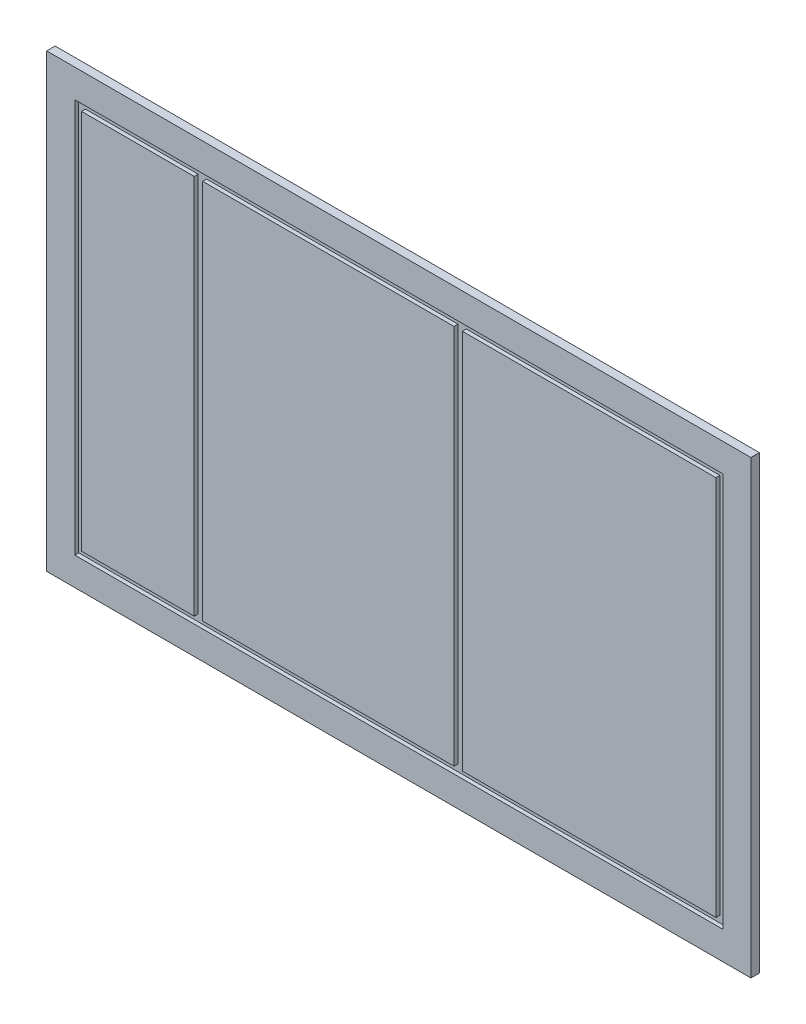
ISO-10303-21;
HEADER;
FILE_DESCRIPTION(('STEP AP214'),'2;1');
FILE_NAME('part.step','',(''),(''),'','','');
FILE_SCHEMA(('AUTOMOTIVE_DESIGN { 1 0 10303 214 1 1 1 1 }'));
ENDSEC;
DATA;
#1=APPLICATION_CONTEXT('core data for automotive mechanical design processes');
#2=APPLICATION_PROTOCOL_DEFINITION('international standard','automotive_design',2000,#1);
#3=PRODUCT_CONTEXT('',#1,'mechanical');
#4=PRODUCT('Part','Part','',(#3));
#5=PRODUCT_RELATED_PRODUCT_CATEGORY('part','',(#4));
#6=PRODUCT_DEFINITION_FORMATION('','',#4);
#7=PRODUCT_DEFINITION_CONTEXT('part definition',#1,'design');
#8=PRODUCT_DEFINITION('design','',#6,#7);
#9=PRODUCT_DEFINITION_SHAPE('','',#8);
#10=(LENGTH_UNIT() NAMED_UNIT(*) SI_UNIT(.MILLI.,.METRE.));
#11=(NAMED_UNIT(*) PLANE_ANGLE_UNIT() SI_UNIT($,.RADIAN.));
#12=(NAMED_UNIT(*) SI_UNIT($,.STERADIAN.) SOLID_ANGLE_UNIT());
#13=UNCERTAINTY_MEASURE_WITH_UNIT(LENGTH_MEASURE(1.E-05),#10,'distance_accuracy_value','');
#14=(GEOMETRIC_REPRESENTATION_CONTEXT(3) GLOBAL_UNCERTAINTY_ASSIGNED_CONTEXT((#13)) GLOBAL_UNIT_ASSIGNED_CONTEXT((#10,
#11,#12)) REPRESENTATION_CONTEXT('',''));
#15=CARTESIAN_POINT('',(0.,0.,0.));
#16=DIRECTION('',(0.,0.,1.));
#17=DIRECTION('',(1.,0.,0.));
#18=AXIS2_PLACEMENT_3D('',#15,#16,#17);
#19=CARTESIAN_POINT('',(563.,338.,8.));
#20=DIRECTION('',(0.,1.,0.));
#21=DIRECTION('',(0.,0.,1.));
#22=AXIS2_PLACEMENT_3D('',#19,#20,#21);
#23=PLANE('',#22);
#24=DIRECTION('',(0.,0.,1.));
#25=VECTOR('',#24,1.);
#26=CARTESIAN_POINT('',(98.0000000000003,338.,8.));
#27=LINE('',#26,#25);
#28=CARTESIAN_POINT('',(98.0000000000003,338.,8.));
#29=VERTEX_POINT('',#28);
#30=CARTESIAN_POINT('',(98.0000000000003,338.,15.));
#31=VERTEX_POINT('',#30);
#32=EDGE_CURVE('E357',#29,#31,#27,.T.);
#33=ORIENTED_EDGE('',*,*,#32,.F.);
#34=DIRECTION('',(-1.,0.,0.));
#35=VECTOR('',#34,1.);
#36=CARTESIAN_POINT('',(563.,338.,8.));
#37=LINE('',#36,#35);
#38=CARTESIAN_POINT('',(-348.,338.,8.));
#39=VERTEX_POINT('',#38);
#40=EDGE_CURVE('E192',#29,#39,#37,.T.);
#41=ORIENTED_EDGE('',*,*,#40,.T.);
#42=DIRECTION('',(0.,0.,1.));
#43=VECTOR('',#42,1.);
#44=CARTESIAN_POINT('',(-348.,338.,8.));
#45=LINE('',#44,#43);
#46=CARTESIAN_POINT('',(-348.,338.,15.));
#47=VERTEX_POINT('',#46);
#48=EDGE_CURVE('E386',#39,#47,#45,.T.);
#49=ORIENTED_EDGE('',*,*,#48,.T.);
#50=DIRECTION('',(-1.,0.,0.));
#51=VECTOR('',#50,1.);
#52=CARTESIAN_POINT('',(563.,338.,15.));
#53=LINE('',#52,#51);
#54=EDGE_CURVE('E228',#31,#47,#53,.T.);
#55=ORIENTED_EDGE('',*,*,#54,.F.);
#56=EDGE_LOOP('',(#33,#41,#49,#55));
#57=FACE_BOUND('',#56,.T.);
#58=ADVANCED_FACE('F35',(#57),#23,.T.);
#59=CARTESIAN_POINT('',(563.,-338.,8.));
#60=DIRECTION('',(0.,-1.,0.));
#61=DIRECTION('',(0.,0.,-1.));
#62=AXIS2_PLACEMENT_3D('',#59,#60,#61);
#63=PLANE('',#62);
#64=DIRECTION('',(0.,0.,1.));
#65=VECTOR('',#64,1.);
#66=CARTESIAN_POINT('',(98.0000000000004,-338.,8.));
#67=LINE('',#66,#65);
#68=CARTESIAN_POINT('',(98.0000000000004,-338.,8.));
#69=VERTEX_POINT('',#68);
#70=CARTESIAN_POINT('',(98.0000000000004,-338.,15.));
#71=VERTEX_POINT('',#70);
#72=EDGE_CURVE('E172',#69,#71,#67,.T.);
#73=ORIENTED_EDGE('',*,*,#72,.T.);
#74=DIRECTION('',(1.,0.,0.));
#75=VECTOR('',#74,1.);
#76=CARTESIAN_POINT('',(563.,-338.,15.));
#77=LINE('',#76,#75);
#78=CARTESIAN_POINT('',(-348.,-338.,15.));
#79=VERTEX_POINT('',#78);
#80=EDGE_CURVE('E221',#79,#71,#77,.T.);
#81=ORIENTED_EDGE('',*,*,#80,.F.);
#82=DIRECTION('',(0.,0.,1.));
#83=VECTOR('',#82,1.);
#84=CARTESIAN_POINT('',(-348.,-338.,8.));
#85=LINE('',#84,#83);
#86=CARTESIAN_POINT('',(-348.,-338.,8.));
#87=VERTEX_POINT('',#86);
#88=EDGE_CURVE('E58',#87,#79,#85,.T.);
#89=ORIENTED_EDGE('',*,*,#88,.F.);
#90=DIRECTION('',(1.,0.,0.));
#91=VECTOR('',#90,1.);
#92=CARTESIAN_POINT('',(563.,-338.,8.));
#93=LINE('',#92,#91);
#94=EDGE_CURVE('E191',#87,#69,#93,.T.);
#95=ORIENTED_EDGE('',*,*,#94,.T.);
#96=EDGE_LOOP('',(#73,#81,#89,#95));
#97=FACE_BOUND('',#96,.T.);
#98=ADVANCED_FACE('F195',(#97),#63,.T.);
#99=CARTESIAN_POINT('',(0.,0.,15.));
#100=DIRECTION('',(0.,0.,1.));
#101=DIRECTION('',(1.,0.,0.));
#102=AXIS2_PLACEMENT_3D('',#99,#100,#101);
#103=PLANE('',#102);
#104=DIRECTION('',(0.,-1.,0.));
#105=VECTOR('',#104,1.);
#106=CARTESIAN_POINT('',(98.0000000000003,338.,15.));
#107=LINE('',#106,#105);
#108=EDGE_CURVE('E178',#31,#71,#107,.T.);
#109=ORIENTED_EDGE('',*,*,#108,.F.);
#110=ORIENTED_EDGE('',*,*,#54,.T.);
#111=DIRECTION('',(0.,1.,0.));
#112=VECTOR('',#111,1.);
#113=CARTESIAN_POINT('',(-348.,338.,15.));
#114=LINE('',#113,#112);
#115=EDGE_CURVE('E380',#79,#47,#114,.T.);
#116=ORIENTED_EDGE('',*,*,#115,.F.);
#117=ORIENTED_EDGE('',*,*,#80,.T.);
#118=EDGE_LOOP('',(#109,#110,#116,#117));
#119=FACE_BOUND('',#118,.T.);
#120=ADVANCED_FACE('F331',(#119),#103,.T.);
#121=DIRECTION('',(0.,0.,1.));
#122=VECTOR('',#121,1.);
#123=CARTESIAN_POINT('',(-363.,338.,8.));
#124=LINE('',#123,#122);
#125=CARTESIAN_POINT('',(-363.,338.,8.));
#126=VERTEX_POINT('',#125);
#127=CARTESIAN_POINT('',(-363.,338.,15.));
#128=VERTEX_POINT('',#127);
#129=EDGE_CURVE('E216',#126,#128,#124,.T.);
#130=ORIENTED_EDGE('',*,*,#129,.F.);
#131=CARTESIAN_POINT('',(-563.,338.,8.));
#132=VERTEX_POINT('',#131);
#133=EDGE_CURVE('E207',#126,#132,#37,.T.);
#134=ORIENTED_EDGE('',*,*,#133,.T.);
#135=DIRECTION('',(0.,0.,1.));
#136=VECTOR('',#135,1.);
#137=CARTESIAN_POINT('',(-563.,338.,8.));
#138=LINE('',#137,#136);
#139=CARTESIAN_POINT('',(-563.,338.,15.));
#140=VERTEX_POINT('',#139);
#141=EDGE_CURVE('E229',#132,#140,#138,.T.);
#142=ORIENTED_EDGE('',*,*,#141,.T.);
#143=EDGE_CURVE('E224',#128,#140,#53,.T.);
#144=ORIENTED_EDGE('',*,*,#143,.F.);
#145=EDGE_LOOP('',(#130,#134,#142,#144));
#146=FACE_BOUND('',#145,.T.);
#147=ADVANCED_FACE('F325',(#146),#23,.T.);
#148=DIRECTION('',(0.,0.,1.));
#149=VECTOR('',#148,1.);
#150=CARTESIAN_POINT('',(-363.,-338.,8.));
#151=LINE('',#150,#149);
#152=CARTESIAN_POINT('',(-363.,-338.,8.));
#153=VERTEX_POINT('',#152);
#154=CARTESIAN_POINT('',(-363.,-338.,15.));
#155=VERTEX_POINT('',#154);
#156=EDGE_CURVE('E382',#153,#155,#151,.T.);
#157=ORIENTED_EDGE('',*,*,#156,.T.);
#158=CARTESIAN_POINT('',(-563.,-338.,15.));
#159=VERTEX_POINT('',#158);
#160=EDGE_CURVE('E217',#159,#155,#77,.T.);
#161=ORIENTED_EDGE('',*,*,#160,.F.);
#162=DIRECTION('',(0.,0.,1.));
#163=VECTOR('',#162,1.);
#164=CARTESIAN_POINT('',(-563.,-338.,8.));
#165=LINE('',#164,#163);
#166=CARTESIAN_POINT('',(-563.,-338.,8.));
#167=VERTEX_POINT('',#166);
#168=EDGE_CURVE('E211',#167,#159,#165,.T.);
#169=ORIENTED_EDGE('',*,*,#168,.F.);
#170=EDGE_CURVE('E196',#167,#153,#93,.T.);
#171=ORIENTED_EDGE('',*,*,#170,.T.);
#172=EDGE_LOOP('',(#157,#161,#169,#171));
#173=FACE_BOUND('',#172,.T.);
#174=ADVANCED_FACE('F333',(#173),#63,.T.);
#175=DIRECTION('',(0.,-1.,0.));
#176=VECTOR('',#175,1.);
#177=CARTESIAN_POINT('',(-363.,338.,15.));
#178=LINE('',#177,#176);
#179=EDGE_CURVE('E373',#128,#155,#178,.T.);
#180=ORIENTED_EDGE('',*,*,#179,.F.);
#181=ORIENTED_EDGE('',*,*,#143,.T.);
#182=DIRECTION('',(0.,-1.,0.));
#183=VECTOR('',#182,1.);
#184=CARTESIAN_POINT('',(-563.,-338.,15.));
#185=LINE('',#184,#183);
#186=EDGE_CURVE('E212',#140,#159,#185,.T.);
#187=ORIENTED_EDGE('',*,*,#186,.T.);
#188=ORIENTED_EDGE('',*,*,#160,.T.);
#189=EDGE_LOOP('',(#180,#181,#187,#188));
#190=FACE_BOUND('',#189,.T.);
#191=ADVANCED_FACE('F321',(#190),#103,.T.);
#192=CARTESIAN_POINT('',(-625.,-400.,15.));
#193=DIRECTION('',(1.,0.,0.));
#194=DIRECTION('',(0.,0.,-1.));
#195=AXIS2_PLACEMENT_3D('',#192,#193,#194);
#196=PLANE('',#195);
#197=DIRECTION('',(0.,-1.,0.));
#198=VECTOR('',#197,1.);
#199=CARTESIAN_POINT('',(-625.,-400.,0.));
#200=LINE('',#199,#198);
#201=CARTESIAN_POINT('',(-625.,400.,0.));
#202=VERTEX_POINT('',#201);
#203=CARTESIAN_POINT('',(-625.,-400.,0.));
#204=VERTEX_POINT('',#203);
#205=EDGE_CURVE('E264',#202,#204,#200,.T.);
#206=ORIENTED_EDGE('',*,*,#205,.T.);
#207=DIRECTION('',(0.,0.,-1.));
#208=VECTOR('',#207,1.);
#209=CARTESIAN_POINT('',(-625.,-400.,15.));
#210=LINE('',#209,#208);
#211=CARTESIAN_POINT('',(-625.,-400.,15.));
#212=VERTEX_POINT('',#211);
#213=EDGE_CURVE('E11',#212,#204,#210,.T.);
#214=ORIENTED_EDGE('',*,*,#213,.F.);
#215=DIRECTION('',(0.,-1.,0.));
#216=VECTOR('',#215,1.);
#217=CARTESIAN_POINT('',(-625.,-400.,15.));
#218=LINE('',#217,#216);
#219=CARTESIAN_POINT('',(-625.,400.,15.));
#220=VERTEX_POINT('',#219);
#221=EDGE_CURVE('E271',#220,#212,#218,.T.);
#222=ORIENTED_EDGE('',*,*,#221,.F.);
#223=DIRECTION('',(0.,0.,-1.));
#224=VECTOR('',#223,1.);
#225=CARTESIAN_POINT('',(-625.,400.,15.));
#226=LINE('',#225,#224);
#227=EDGE_CURVE('E281',#220,#202,#226,.T.);
#228=ORIENTED_EDGE('',*,*,#227,.T.);
#229=EDGE_LOOP('',(#206,#214,#222,#228));
#230=FACE_BOUND('',#229,.T.);
#231=ADVANCED_FACE('F37',(#230),#196,.F.);
#232=CARTESIAN_POINT('',(625.,-400.,15.));
#233=DIRECTION('',(0.,1.,0.));
#234=DIRECTION('',(-1.,0.,0.));
#235=AXIS2_PLACEMENT_3D('',#232,#233,#234);
#236=PLANE('',#235);
#237=DIRECTION('',(1.,0.,0.));
#238=VECTOR('',#237,1.);
#239=CARTESIAN_POINT('',(625.,-400.,0.));
#240=LINE('',#239,#238);
#241=CARTESIAN_POINT('',(625.,-400.,0.));
#242=VERTEX_POINT('',#241);
#243=EDGE_CURVE('E284',#204,#242,#240,.T.);
#244=ORIENTED_EDGE('',*,*,#243,.T.);
#245=DIRECTION('',(0.,0.,-1.));
#246=VECTOR('',#245,1.);
#247=CARTESIAN_POINT('',(625.,-400.,15.));
#248=LINE('',#247,#246);
#249=CARTESIAN_POINT('',(625.,-400.,15.));
#250=VERTEX_POINT('',#249);
#251=EDGE_CURVE('E43',#250,#242,#248,.T.);
#252=ORIENTED_EDGE('',*,*,#251,.F.);
#253=DIRECTION('',(1.,0.,0.));
#254=VECTOR('',#253,1.);
#255=CARTESIAN_POINT('',(625.,-400.,15.));
#256=LINE('',#255,#254);
#257=EDGE_CURVE('E274',#212,#250,#256,.T.);
#258=ORIENTED_EDGE('',*,*,#257,.F.);
#259=ORIENTED_EDGE('',*,*,#213,.T.);
#260=EDGE_LOOP('',(#244,#252,#258,#259));
#261=FACE_BOUND('',#260,.T.);
#262=ADVANCED_FACE('F314',(#261),#236,.F.);
#263=CARTESIAN_POINT('',(625.,-400.,15.));
#264=DIRECTION('',(-1.,0.,0.));
#265=DIRECTION('',(0.,0.,1.));
#266=AXIS2_PLACEMENT_3D('',#263,#264,#265);
#267=PLANE('',#266);
#268=DIRECTION('',(0.,1.,0.));
#269=VECTOR('',#268,1.);
#270=CARTESIAN_POINT('',(625.,-400.,0.));
#271=LINE('',#270,#269);
#272=CARTESIAN_POINT('',(625.,400.,0.));
#273=VERTEX_POINT('',#272);
#274=EDGE_CURVE('E286',#242,#273,#271,.T.);
#275=ORIENTED_EDGE('',*,*,#274,.T.);
#276=DIRECTION('',(0.,0.,-1.));
#277=VECTOR('',#276,1.);
#278=CARTESIAN_POINT('',(625.,400.,15.));
#279=LINE('',#278,#277);
#280=CARTESIAN_POINT('',(625.,400.,15.));
#281=VERTEX_POINT('',#280);
#282=EDGE_CURVE('E291',#281,#273,#279,.T.);
#283=ORIENTED_EDGE('',*,*,#282,.F.);
#284=DIRECTION('',(0.,1.,0.));
#285=VECTOR('',#284,1.);
#286=CARTESIAN_POINT('',(625.,-400.,15.));
#287=LINE('',#286,#285);
#288=EDGE_CURVE('E277',#250,#281,#287,.T.);
#289=ORIENTED_EDGE('',*,*,#288,.F.);
#290=ORIENTED_EDGE('',*,*,#251,.T.);
#291=EDGE_LOOP('',(#275,#283,#289,#290));
#292=FACE_BOUND('',#291,.T.);
#293=ADVANCED_FACE('F298',(#292),#267,.F.);
#294=CARTESIAN_POINT('',(625.,400.,15.));
#295=DIRECTION('',(0.,-1.,0.));
#296=DIRECTION('',(1.,0.,0.));
#297=AXIS2_PLACEMENT_3D('',#294,#295,#296);
#298=PLANE('',#297);
#299=DIRECTION('',(-1.,0.,0.));
#300=VECTOR('',#299,1.);
#301=CARTESIAN_POINT('',(625.,400.,0.));
#302=LINE('',#301,#300);
#303=EDGE_CURVE('E275',#273,#202,#302,.T.);
#304=ORIENTED_EDGE('',*,*,#303,.T.);
#305=ORIENTED_EDGE('',*,*,#227,.F.);
#306=DIRECTION('',(-1.,0.,0.));
#307=VECTOR('',#306,1.);
#308=CARTESIAN_POINT('',(625.,400.,15.));
#309=LINE('',#308,#307);
#310=EDGE_CURVE('E279',#281,#220,#309,.T.);
#311=ORIENTED_EDGE('',*,*,#310,.F.);
#312=ORIENTED_EDGE('',*,*,#282,.T.);
#313=EDGE_LOOP('',(#304,#305,#311,#312));
#314=FACE_BOUND('',#313,.T.);
#315=ADVANCED_FACE('F307',(#314),#298,.F.);
#316=DIRECTION('',(0.,-1.,0.));
#317=VECTOR('',#316,1.);
#318=CARTESIAN_POINT('',(-575.,-350.,15.));
#319=LINE('',#318,#317);
#320=CARTESIAN_POINT('',(-575.,350.,15.));
#321=VERTEX_POINT('',#320);
#322=CARTESIAN_POINT('',(-575.,-350.,15.));
#323=VERTEX_POINT('',#322);
#324=EDGE_CURVE('E232',#321,#323,#319,.T.);
#325=ORIENTED_EDGE('',*,*,#324,.F.);
#326=DIRECTION('',(-1.,0.,0.));
#327=VECTOR('',#326,1.);
#328=CARTESIAN_POINT('',(575.,350.,15.));
#329=LINE('',#328,#327);
#330=CARTESIAN_POINT('',(575.,350.,15.));
#331=VERTEX_POINT('',#330);
#332=EDGE_CURVE('E243',#331,#321,#329,.T.);
#333=ORIENTED_EDGE('',*,*,#332,.F.);
#334=DIRECTION('',(0.,1.,0.));
#335=VECTOR('',#334,1.);
#336=CARTESIAN_POINT('',(575.,-350.,15.));
#337=LINE('',#336,#335);
#338=CARTESIAN_POINT('',(575.,-350.,15.));
#339=VERTEX_POINT('',#338);
#340=EDGE_CURVE('E257',#339,#331,#337,.T.);
#341=ORIENTED_EDGE('',*,*,#340,.F.);
#342=DIRECTION('',(1.,0.,0.));
#343=VECTOR('',#342,1.);
#344=CARTESIAN_POINT('',(575.,-350.,15.));
#345=LINE('',#344,#343);
#346=EDGE_CURVE('E254',#323,#339,#345,.T.);
#347=ORIENTED_EDGE('',*,*,#346,.F.);
#348=EDGE_LOOP('',(#325,#333,#341,#347));
#349=FACE_BOUND('',#348,.T.);
#350=ORIENTED_EDGE('',*,*,#221,.T.);
#351=ORIENTED_EDGE('',*,*,#257,.T.);
#352=ORIENTED_EDGE('',*,*,#288,.T.);
#353=ORIENTED_EDGE('',*,*,#310,.T.);
#354=EDGE_LOOP('',(#350,#351,#352,#353));
#355=FACE_BOUND('',#354,.T.);
#356=ADVANCED_FACE('F313',(#349,#355),#103,.T.);
#357=CARTESIAN_POINT('',(0.,0.,0.));
#358=DIRECTION('',(0.,0.,1.));
#359=DIRECTION('',(1.,0.,0.));
#360=AXIS2_PLACEMENT_3D('',#357,#358,#359);
#361=PLANE('',#360);
#362=ORIENTED_EDGE('',*,*,#205,.F.);
#363=ORIENTED_EDGE('',*,*,#303,.F.);
#364=ORIENTED_EDGE('',*,*,#274,.F.);
#365=ORIENTED_EDGE('',*,*,#243,.F.);
#366=EDGE_LOOP('',(#362,#363,#364,#365));
#367=FACE_BOUND('',#366,.T.);
#368=ADVANCED_FACE('F304',(#367),#361,.F.);
#369=CARTESIAN_POINT('',(-575.,-350.,8.));
#370=DIRECTION('',(-1.,0.,0.));
#371=DIRECTION('',(0.,0.,1.));
#372=AXIS2_PLACEMENT_3D('',#369,#370,#371);
#373=PLANE('',#372);
#374=ORIENTED_EDGE('',*,*,#324,.T.);
#375=DIRECTION('',(0.,0.,1.));
#376=VECTOR('',#375,1.);
#377=CARTESIAN_POINT('',(-575.,-350.,8.));
#378=LINE('',#377,#376);
#379=CARTESIAN_POINT('',(-575.,-350.,8.));
#380=VERTEX_POINT('',#379);
#381=EDGE_CURVE('E252',#380,#323,#378,.T.);
#382=ORIENTED_EDGE('',*,*,#381,.F.);
#383=DIRECTION('',(0.,-1.,0.));
#384=VECTOR('',#383,1.);
#385=CARTESIAN_POINT('',(-575.,-350.,8.));
#386=LINE('',#385,#384);
#387=CARTESIAN_POINT('',(-575.,350.,8.));
#388=VERTEX_POINT('',#387);
#389=EDGE_CURVE('E239',#388,#380,#386,.T.);
#390=ORIENTED_EDGE('',*,*,#389,.F.);
#391=DIRECTION('',(0.,0.,1.));
#392=VECTOR('',#391,1.);
#393=CARTESIAN_POINT('',(-575.,350.,8.));
#394=LINE('',#393,#392);
#395=EDGE_CURVE('E262',#388,#321,#394,.T.);
#396=ORIENTED_EDGE('',*,*,#395,.T.);
#397=EDGE_LOOP('',(#374,#382,#390,#396));
#398=FACE_BOUND('',#397,.T.);
#399=ADVANCED_FACE('F486',(#398),#373,.F.);
#400=CARTESIAN_POINT('',(575.,350.,8.));
#401=DIRECTION('',(0.,1.,0.));
#402=DIRECTION('',(-1.,0.,0.));
#403=AXIS2_PLACEMENT_3D('',#400,#401,#402);
#404=PLANE('',#403);
#405=ORIENTED_EDGE('',*,*,#332,.T.);
#406=ORIENTED_EDGE('',*,*,#395,.F.);
#407=DIRECTION('',(-1.,0.,0.));
#408=VECTOR('',#407,1.);
#409=CARTESIAN_POINT('',(575.,350.,8.));
#410=LINE('',#409,#408);
#411=CARTESIAN_POINT('',(575.,350.,8.));
#412=VERTEX_POINT('',#411);
#413=EDGE_CURVE('E249',#412,#388,#410,.T.);
#414=ORIENTED_EDGE('',*,*,#413,.F.);
#415=DIRECTION('',(0.,0.,1.));
#416=VECTOR('',#415,1.);
#417=CARTESIAN_POINT('',(575.,350.,8.));
#418=LINE('',#417,#416);
#419=EDGE_CURVE('E265',#412,#331,#418,.T.);
#420=ORIENTED_EDGE('',*,*,#419,.T.);
#421=EDGE_LOOP('',(#405,#406,#414,#420));
#422=FACE_BOUND('',#421,.T.);
#423=ADVANCED_FACE('F478',(#422),#404,.F.);
#424=CARTESIAN_POINT('',(575.,-350.,8.));
#425=DIRECTION('',(1.,0.,0.));
#426=DIRECTION('',(0.,0.,-1.));
#427=AXIS2_PLACEMENT_3D('',#424,#425,#426);
#428=PLANE('',#427);
#429=ORIENTED_EDGE('',*,*,#340,.T.);
#430=ORIENTED_EDGE('',*,*,#419,.F.);
#431=DIRECTION('',(0.,1.,0.));
#432=VECTOR('',#431,1.);
#433=CARTESIAN_POINT('',(575.,-350.,8.));
#434=LINE('',#433,#432);
#435=CARTESIAN_POINT('',(575.,-350.,8.));
#436=VERTEX_POINT('',#435);
#437=EDGE_CURVE('E246',#436,#412,#434,.T.);
#438=ORIENTED_EDGE('',*,*,#437,.F.);
#439=DIRECTION('',(0.,0.,1.));
#440=VECTOR('',#439,1.);
#441=CARTESIAN_POINT('',(575.,-350.,8.));
#442=LINE('',#441,#440);
#443=EDGE_CURVE('E267',#436,#339,#442,.T.);
#444=ORIENTED_EDGE('',*,*,#443,.T.);
#445=EDGE_LOOP('',(#429,#430,#438,#444));
#446=FACE_BOUND('',#445,.T.);
#447=ADVANCED_FACE('F470',(#446),#428,.F.);
#448=CARTESIAN_POINT('',(575.,-350.,8.));
#449=DIRECTION('',(0.,-1.,0.));
#450=DIRECTION('',(1.,0.,0.));
#451=AXIS2_PLACEMENT_3D('',#448,#449,#450);
#452=PLANE('',#451);
#453=ORIENTED_EDGE('',*,*,#346,.T.);
#454=ORIENTED_EDGE('',*,*,#443,.F.);
#455=DIRECTION('',(1.,0.,0.));
#456=VECTOR('',#455,1.);
#457=CARTESIAN_POINT('',(575.,-350.,8.));
#458=LINE('',#457,#456);
#459=EDGE_CURVE('E242',#380,#436,#458,.T.);
#460=ORIENTED_EDGE('',*,*,#459,.F.);
#461=ORIENTED_EDGE('',*,*,#381,.T.);
#462=EDGE_LOOP('',(#453,#454,#460,#461));
#463=FACE_BOUND('',#462,.T.);
#464=ADVANCED_FACE('F467',(#463),#452,.F.);
#465=CARTESIAN_POINT('',(0.,0.,8.));
#466=DIRECTION('',(0.,0.,1.));
#467=DIRECTION('',(1.,0.,0.));
#468=AXIS2_PLACEMENT_3D('',#465,#466,#467);
#469=PLANE('',#468);
#470=ORIENTED_EDGE('',*,*,#40,.F.);
#471=DIRECTION('',(0.,-1.,0.));
#472=VECTOR('',#471,1.);
#473=CARTESIAN_POINT('',(98.0000000000003,338.,8.));
#474=LINE('',#473,#472);
#475=EDGE_CURVE('E175',#29,#69,#474,.T.);
#476=ORIENTED_EDGE('',*,*,#475,.T.);
#477=ORIENTED_EDGE('',*,*,#94,.F.);
#478=DIRECTION('',(0.,1.,0.));
#479=VECTOR('',#478,1.);
#480=CARTESIAN_POINT('',(-348.,338.,8.));
#481=LINE('',#480,#479);
#482=EDGE_CURVE('E379',#87,#39,#481,.T.);
#483=ORIENTED_EDGE('',*,*,#482,.T.);
#484=EDGE_LOOP('',(#470,#476,#477,#483));
#485=FACE_BOUND('',#484,.T.);
#486=ORIENTED_EDGE('',*,*,#133,.F.);
#487=DIRECTION('',(0.,-1.,0.));
#488=VECTOR('',#487,1.);
#489=CARTESIAN_POINT('',(-363.,338.,8.));
#490=LINE('',#489,#488);
#491=EDGE_CURVE('E376',#126,#153,#490,.T.);
#492=ORIENTED_EDGE('',*,*,#491,.T.);
#493=ORIENTED_EDGE('',*,*,#170,.F.);
#494=DIRECTION('',(0.,-1.,0.));
#495=VECTOR('',#494,1.);
#496=CARTESIAN_POINT('',(-563.,-338.,8.));
#497=LINE('',#496,#495);
#498=EDGE_CURVE('E201',#132,#167,#497,.T.);
#499=ORIENTED_EDGE('',*,*,#498,.F.);
#500=EDGE_LOOP('',(#486,#492,#493,#499));
#501=FACE_BOUND('',#500,.T.);
#502=CARTESIAN_POINT('',(563.,338.,8.));
#503=VERTEX_POINT('',#502);
#504=CARTESIAN_POINT('',(113.,338.,8.));
#505=VERTEX_POINT('',#504);
#506=EDGE_CURVE('E208',#503,#505,#37,.T.);
#507=ORIENTED_EDGE('',*,*,#506,.F.);
#508=DIRECTION('',(0.,1.,0.));
#509=VECTOR('',#508,1.);
#510=CARTESIAN_POINT('',(563.,-338.,8.));
#511=LINE('',#510,#509);
#512=CARTESIAN_POINT('',(563.,-338.,8.));
#513=VERTEX_POINT('',#512);
#514=EDGE_CURVE('E200',#513,#503,#511,.T.);
#515=ORIENTED_EDGE('',*,*,#514,.F.);
#516=CARTESIAN_POINT('',(113.,-338.,8.));
#517=VERTEX_POINT('',#516);
#518=EDGE_CURVE('E197',#517,#513,#93,.T.);
#519=ORIENTED_EDGE('',*,*,#518,.F.);
#520=DIRECTION('',(0.,1.,0.));
#521=VECTOR('',#520,1.);
#522=CARTESIAN_POINT('',(113.,338.,8.));
#523=LINE('',#522,#521);
#524=EDGE_CURVE('E183',#517,#505,#523,.T.);
#525=ORIENTED_EDGE('',*,*,#524,.T.);
#526=EDGE_LOOP('',(#507,#515,#519,#525));
#527=FACE_BOUND('',#526,.T.);
#528=ORIENTED_EDGE('',*,*,#389,.T.);
#529=ORIENTED_EDGE('',*,*,#459,.T.);
#530=ORIENTED_EDGE('',*,*,#437,.T.);
#531=ORIENTED_EDGE('',*,*,#413,.T.);
#532=EDGE_LOOP('',(#528,#529,#530,#531));
#533=FACE_BOUND('',#532,.T.);
#534=ADVANCED_FACE('F188',(#485,#501,#527,#533),#469,.T.);
#535=CARTESIAN_POINT('',(-563.,-338.,8.));
#536=DIRECTION('',(-1.,0.,0.));
#537=DIRECTION('',(0.,0.,1.));
#538=AXIS2_PLACEMENT_3D('',#535,#536,#537);
#539=PLANE('',#538);
#540=ORIENTED_EDGE('',*,*,#186,.F.);
#541=ORIENTED_EDGE('',*,*,#141,.F.);
#542=ORIENTED_EDGE('',*,*,#498,.T.);
#543=ORIENTED_EDGE('',*,*,#168,.T.);
#544=EDGE_LOOP('',(#540,#541,#542,#543));
#545=FACE_BOUND('',#544,.T.);
#546=ADVANCED_FACE('F341',(#545),#539,.T.);
#547=DIRECTION('',(0.,0.,1.));
#548=VECTOR('',#547,1.);
#549=CARTESIAN_POINT('',(113.,338.,8.));
#550=LINE('',#549,#548);
#551=CARTESIAN_POINT('',(113.,338.,15.));
#552=VERTEX_POINT('',#551);
#553=EDGE_CURVE('E354',#505,#552,#550,.T.);
#554=ORIENTED_EDGE('',*,*,#553,.T.);
#555=CARTESIAN_POINT('',(563.,338.,15.));
#556=VERTEX_POINT('',#555);
#557=EDGE_CURVE('E225',#556,#552,#53,.T.);
#558=ORIENTED_EDGE('',*,*,#557,.F.);
#559=DIRECTION('',(0.,0.,1.));
#560=VECTOR('',#559,1.);
#561=CARTESIAN_POINT('',(563.,338.,8.));
#562=LINE('',#561,#560);
#563=EDGE_CURVE('E233',#503,#556,#562,.T.);
#564=ORIENTED_EDGE('',*,*,#563,.F.);
#565=ORIENTED_EDGE('',*,*,#506,.T.);
#566=EDGE_LOOP('',(#554,#558,#564,#565));
#567=FACE_BOUND('',#566,.T.);
#568=ADVANCED_FACE('F326',(#567),#23,.T.);
#569=CARTESIAN_POINT('',(563.,-338.,8.));
#570=DIRECTION('',(1.,0.,0.));
#571=DIRECTION('',(0.,0.,-1.));
#572=AXIS2_PLACEMENT_3D('',#569,#570,#571);
#573=PLANE('',#572);
#574=DIRECTION('',(0.,1.,0.));
#575=VECTOR('',#574,1.);
#576=CARTESIAN_POINT('',(563.,-338.,15.));
#577=LINE('',#576,#575);
#578=CARTESIAN_POINT('',(563.,-338.,15.));
#579=VERTEX_POINT('',#578);
#580=EDGE_CURVE('E220',#579,#556,#577,.T.);
#581=ORIENTED_EDGE('',*,*,#580,.F.);
#582=DIRECTION('',(0.,0.,1.));
#583=VECTOR('',#582,1.);
#584=CARTESIAN_POINT('',(563.,-338.,8.));
#585=LINE('',#584,#583);
#586=EDGE_CURVE('E235',#513,#579,#585,.T.);
#587=ORIENTED_EDGE('',*,*,#586,.F.);
#588=ORIENTED_EDGE('',*,*,#514,.T.);
#589=ORIENTED_EDGE('',*,*,#563,.T.);
#590=EDGE_LOOP('',(#581,#587,#588,#589));
#591=FACE_BOUND('',#590,.T.);
#592=ADVANCED_FACE('F340',(#591),#573,.T.);
#593=DIRECTION('',(0.,0.,1.));
#594=VECTOR('',#593,1.);
#595=CARTESIAN_POINT('',(113.,-338.,8.));
#596=LINE('',#595,#594);
#597=CARTESIAN_POINT('',(113.,-338.,15.));
#598=VERTEX_POINT('',#597);
#599=EDGE_CURVE('E50',#517,#598,#596,.T.);
#600=ORIENTED_EDGE('',*,*,#599,.F.);
#601=ORIENTED_EDGE('',*,*,#518,.T.);
#602=ORIENTED_EDGE('',*,*,#586,.T.);
#603=EDGE_CURVE('E215',#598,#579,#77,.T.);
#604=ORIENTED_EDGE('',*,*,#603,.F.);
#605=EDGE_LOOP('',(#600,#601,#602,#604));
#606=FACE_BOUND('',#605,.T.);
#607=ADVANCED_FACE('F334',(#606),#63,.T.);
#608=DIRECTION('',(0.,1.,0.));
#609=VECTOR('',#608,1.);
#610=CARTESIAN_POINT('',(113.,338.,15.));
#611=LINE('',#610,#609);
#612=EDGE_CURVE('E193',#598,#552,#611,.T.);
#613=ORIENTED_EDGE('',*,*,#612,.F.);
#614=ORIENTED_EDGE('',*,*,#603,.T.);
#615=ORIENTED_EDGE('',*,*,#580,.T.);
#616=ORIENTED_EDGE('',*,*,#557,.T.);
#617=EDGE_LOOP('',(#613,#614,#615,#616));
#618=FACE_BOUND('',#617,.T.);
#619=ADVANCED_FACE('F360',(#618),#103,.T.);
#620=CARTESIAN_POINT('',(-363.,338.,8.));
#621=DIRECTION('',(-1.,0.,0.));
#622=DIRECTION('',(0.,-1.,0.));
#623=AXIS2_PLACEMENT_3D('',#620,#621,#622);
#624=PLANE('',#623);
#625=ORIENTED_EDGE('',*,*,#179,.T.);
#626=ORIENTED_EDGE('',*,*,#156,.F.);
#627=ORIENTED_EDGE('',*,*,#491,.F.);
#628=ORIENTED_EDGE('',*,*,#129,.T.);
#629=EDGE_LOOP('',(#625,#626,#627,#628));
#630=FACE_BOUND('',#629,.T.);
#631=ADVANCED_FACE('F403',(#630),#624,.F.);
#632=CARTESIAN_POINT('',(-348.,338.,8.));
#633=DIRECTION('',(1.,0.,0.));
#634=DIRECTION('',(0.,1.,0.));
#635=AXIS2_PLACEMENT_3D('',#632,#633,#634);
#636=PLANE('',#635);
#637=ORIENTED_EDGE('',*,*,#115,.T.);
#638=ORIENTED_EDGE('',*,*,#48,.F.);
#639=ORIENTED_EDGE('',*,*,#482,.F.);
#640=ORIENTED_EDGE('',*,*,#88,.T.);
#641=EDGE_LOOP('',(#637,#638,#639,#640));
#642=FACE_BOUND('',#641,.T.);
#643=ADVANCED_FACE('F407',(#642),#636,.F.);
#644=CARTESIAN_POINT('',(98.0000000000003,338.,8.));
#645=DIRECTION('',(-1.,0.,0.));
#646=DIRECTION('',(0.,-1.,0.));
#647=AXIS2_PLACEMENT_3D('',#644,#645,#646);
#648=PLANE('',#647);
#649=ORIENTED_EDGE('',*,*,#108,.T.);
#650=ORIENTED_EDGE('',*,*,#72,.F.);
#651=ORIENTED_EDGE('',*,*,#475,.F.);
#652=ORIENTED_EDGE('',*,*,#32,.T.);
#653=EDGE_LOOP('',(#649,#650,#651,#652));
#654=FACE_BOUND('',#653,.T.);
#655=ADVANCED_FACE('F174',(#654),#648,.F.);
#656=CARTESIAN_POINT('',(113.,338.,8.));
#657=DIRECTION('',(1.,0.,0.));
#658=DIRECTION('',(0.,1.,0.));
#659=AXIS2_PLACEMENT_3D('',#656,#657,#658);
#660=PLANE('',#659);
#661=ORIENTED_EDGE('',*,*,#612,.T.);
#662=ORIENTED_EDGE('',*,*,#553,.F.);
#663=ORIENTED_EDGE('',*,*,#524,.F.);
#664=ORIENTED_EDGE('',*,*,#599,.T.);
#665=EDGE_LOOP('',(#661,#662,#663,#664));
#666=FACE_BOUND('',#665,.T.);
#667=ADVANCED_FACE('F414',(#666),#660,.F.);
#668=CLOSED_SHELL('',(#58,#98,#120,#147,#174,#191,#231,#262,#293,#315,#356,#368,#399,#423,#447,
#464,#534,#546,#568,#592,#607,#619,#631,#643,#655,#667));
#669=MANIFOLD_SOLID_BREP('B2',#668);
#670=ADVANCED_BREP_SHAPE_REPRESENTATION('',(#18,#669),#14);
#671=SHAPE_DEFINITION_REPRESENTATION(#9,#670);
ENDSEC;
END-ISO-10303-21;
